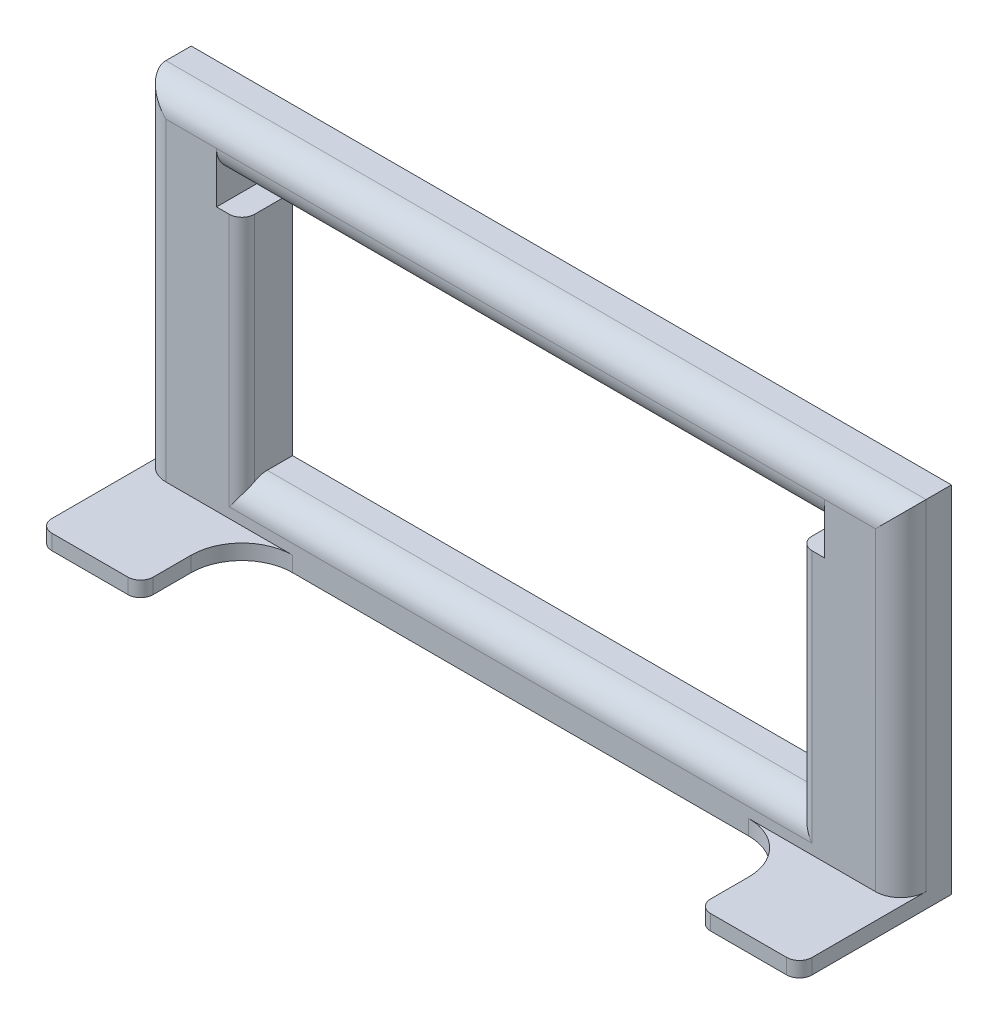
ISO-10303-21;
HEADER;
FILE_DESCRIPTION(('STEP AP214'),'2;1');
FILE_NAME('part.step','',(''),(''),'','','');
FILE_SCHEMA(('AUTOMOTIVE_DESIGN { 1 0 10303 214 1 1 1 1 }'));
ENDSEC;
DATA;
#1=APPLICATION_CONTEXT('core data for automotive mechanical design processes');
#2=APPLICATION_PROTOCOL_DEFINITION('international standard','automotive_design',2000,#1);
#3=PRODUCT_CONTEXT('',#1,'mechanical');
#4=PRODUCT('Part','Part','',(#3));
#5=PRODUCT_RELATED_PRODUCT_CATEGORY('part','',(#4));
#6=PRODUCT_DEFINITION_FORMATION('','',#4);
#7=PRODUCT_DEFINITION_CONTEXT('part definition',#1,'design');
#8=PRODUCT_DEFINITION('design','',#6,#7);
#9=PRODUCT_DEFINITION_SHAPE('','',#8);
#10=(LENGTH_UNIT() NAMED_UNIT(*) SI_UNIT(.MILLI.,.METRE.));
#11=(NAMED_UNIT(*) PLANE_ANGLE_UNIT() SI_UNIT($,.RADIAN.));
#12=(NAMED_UNIT(*) SI_UNIT($,.STERADIAN.) SOLID_ANGLE_UNIT());
#13=UNCERTAINTY_MEASURE_WITH_UNIT(LENGTH_MEASURE(1.E-05),#10,'distance_accuracy_value','');
#14=(GEOMETRIC_REPRESENTATION_CONTEXT(3) GLOBAL_UNCERTAINTY_ASSIGNED_CONTEXT((#13)) GLOBAL_UNIT_ASSIGNED_CONTEXT((#10,
#11,#12)) REPRESENTATION_CONTEXT('',''));
#15=CARTESIAN_POINT('',(0.,0.,0.));
#16=DIRECTION('',(0.,0.,1.));
#17=DIRECTION('',(1.,0.,0.));
#18=AXIS2_PLACEMENT_3D('',#15,#16,#17);
#19=CARTESIAN_POINT('',(0.,-35.,10.));
#20=DIRECTION('',(0.,1.,0.));
#21=DIRECTION('',(0.,0.,1.));
#22=AXIS2_PLACEMENT_3D('',#19,#20,#21);
#23=PLANE('',#22);
#24=DIRECTION('',(0.,0.,-1.));
#25=VECTOR('',#24,1.);
#26=CARTESIAN_POINT('',(75.,-35.,10.));
#27=LINE('',#26,#25);
#28=CARTESIAN_POINT('',(75.,-35.,27.5));
#29=VERTEX_POINT('',#28);
#30=CARTESIAN_POINT('',(75.,-35.,0.));
#31=VERTEX_POINT('',#30);
#32=EDGE_CURVE('E276',#29,#31,#27,.T.);
#33=ORIENTED_EDGE('',*,*,#32,.F.);
#34=CARTESIAN_POINT('',(72.5,-35.,27.5));
#35=DIRECTION('',(0.,1.,0.));
#36=DIRECTION('',(0.,0.,1.));
#37=AXIS2_PLACEMENT_3D('',#34,#35,#36);
#38=CIRCLE('',#37,2.5);
#39=CARTESIAN_POINT('',(72.5,-35.,30.));
#40=VERTEX_POINT('',#39);
#41=EDGE_CURVE('E373',#29,#40,#38,.F.);
#42=ORIENTED_EDGE('',*,*,#41,.T.);
#43=DIRECTION('',(1.,0.,0.));
#44=VECTOR('',#43,1.);
#45=CARTESIAN_POINT('',(-75.,-35.,30.));
#46=LINE('',#45,#44);
#47=CARTESIAN_POINT('',(57.5,-35.,30.));
#48=VERTEX_POINT('',#47);
#49=EDGE_CURVE('E571',#48,#40,#46,.T.);
#50=ORIENTED_EDGE('',*,*,#49,.F.);
#51=CARTESIAN_POINT('',(57.5,-35.,27.5));
#52=DIRECTION('',(0.,1.,0.));
#53=DIRECTION('',(0.,0.,1.));
#54=AXIS2_PLACEMENT_3D('',#51,#52,#53);
#55=CIRCLE('',#54,2.5);
#56=CARTESIAN_POINT('',(55.,-35.,27.5));
#57=VERTEX_POINT('',#56);
#58=EDGE_CURVE('E371',#48,#57,#55,.F.);
#59=ORIENTED_EDGE('',*,*,#58,.T.);
#60=DIRECTION('',(0.,0.,1.));
#61=VECTOR('',#60,1.);
#62=CARTESIAN_POINT('',(55.,-35.,0.));
#63=LINE('',#62,#61);
#64=CARTESIAN_POINT('',(55.,-35.,20.));
#65=VERTEX_POINT('',#64);
#66=EDGE_CURVE('E581',#65,#57,#63,.T.);
#67=ORIENTED_EDGE('',*,*,#66,.F.);
#68=CARTESIAN_POINT('',(45.,-35.,20.));
#69=DIRECTION('',(0.,1.,0.));
#70=DIRECTION('',(0.,0.,1.));
#71=AXIS2_PLACEMENT_3D('',#68,#69,#70);
#72=CIRCLE('',#71,10.);
#73=CARTESIAN_POINT('',(45.,-35.,10.));
#74=VERTEX_POINT('',#73);
#75=EDGE_CURVE('E337',#65,#74,#72,.T.);
#76=ORIENTED_EDGE('',*,*,#75,.T.);
#77=DIRECTION('',(-1.,0.,0.));
#78=VECTOR('',#77,1.);
#79=CARTESIAN_POINT('',(0.,-35.,10.));
#80=LINE('',#79,#78);
#81=CARTESIAN_POINT('',(-45.,-35.,10.));
#82=VERTEX_POINT('',#81);
#83=EDGE_CURVE('E587',#74,#82,#80,.T.);
#84=ORIENTED_EDGE('',*,*,#83,.T.);
#85=CARTESIAN_POINT('',(-45.,-35.,20.));
#86=DIRECTION('',(0.,1.,0.));
#87=DIRECTION('',(0.,0.,1.));
#88=AXIS2_PLACEMENT_3D('',#85,#86,#87);
#89=CIRCLE('',#88,10.);
#90=CARTESIAN_POINT('',(-55.,-35.,20.));
#91=VERTEX_POINT('',#90);
#92=EDGE_CURVE('E342',#82,#91,#89,.T.);
#93=ORIENTED_EDGE('',*,*,#92,.T.);
#94=DIRECTION('',(0.,0.,1.));
#95=VECTOR('',#94,1.);
#96=CARTESIAN_POINT('',(-55.,-35.,0.));
#97=LINE('',#96,#95);
#98=CARTESIAN_POINT('',(-55.,-35.,27.5));
#99=VERTEX_POINT('',#98);
#100=EDGE_CURVE('E584',#91,#99,#97,.T.);
#101=ORIENTED_EDGE('',*,*,#100,.T.);
#102=CARTESIAN_POINT('',(-57.5,-35.,27.5));
#103=DIRECTION('',(0.,1.,0.));
#104=DIRECTION('',(0.,0.,1.));
#105=AXIS2_PLACEMENT_3D('',#102,#103,#104);
#106=CIRCLE('',#105,2.5);
#107=CARTESIAN_POINT('',(-57.5,-35.,30.));
#108=VERTEX_POINT('',#107);
#109=EDGE_CURVE('E367',#99,#108,#106,.F.);
#110=ORIENTED_EDGE('',*,*,#109,.T.);
#111=CARTESIAN_POINT('',(-72.5,-35.,30.));
#112=VERTEX_POINT('',#111);
#113=EDGE_CURVE('E576',#112,#108,#46,.T.);
#114=ORIENTED_EDGE('',*,*,#113,.F.);
#115=CARTESIAN_POINT('',(-72.5,-35.,27.5));
#116=DIRECTION('',(0.,1.,0.));
#117=DIRECTION('',(0.,0.,1.));
#118=AXIS2_PLACEMENT_3D('',#115,#116,#117);
#119=CIRCLE('',#118,2.5);
#120=CARTESIAN_POINT('',(-75.,-35.,27.5));
#121=VERTEX_POINT('',#120);
#122=EDGE_CURVE('E369',#112,#121,#119,.F.);
#123=ORIENTED_EDGE('',*,*,#122,.T.);
#124=DIRECTION('',(0.,0.,-1.));
#125=VECTOR('',#124,1.);
#126=CARTESIAN_POINT('',(-75.,-35.,10.));
#127=LINE('',#126,#125);
#128=CARTESIAN_POINT('',(-75.,-35.,0.));
#129=VERTEX_POINT('',#128);
#130=EDGE_CURVE('E539',#121,#129,#127,.T.);
#131=ORIENTED_EDGE('',*,*,#130,.T.);
#132=DIRECTION('',(1.,0.,0.));
#133=VECTOR('',#132,1.);
#134=CARTESIAN_POINT('',(0.,-35.,0.));
#135=LINE('',#134,#133);
#136=EDGE_CURVE('E535',#129,#31,#135,.T.);
#137=ORIENTED_EDGE('',*,*,#136,.T.);
#138=EDGE_LOOP('',(#33,#42,#50,#59,#67,#76,#84,#93,#101,#110,#114,#123,#131,#137));
#139=FACE_BOUND('',#138,.T.);
#140=ADVANCED_FACE('F35',(#139),#23,.F.);
#141=CARTESIAN_POINT('',(-75.,-32.,30.));
#142=DIRECTION('',(0.,-1.,0.));
#143=DIRECTION('',(0.,0.,-1.));
#144=AXIS2_PLACEMENT_3D('',#141,#142,#143);
#145=PLANE('',#144);
#146=DIRECTION('',(-1.,0.,0.));
#147=VECTOR('',#146,1.);
#148=CARTESIAN_POINT('',(-75.,-32.,30.));
#149=LINE('',#148,#147);
#150=CARTESIAN_POINT('',(72.5,-32.,30.));
#151=VERTEX_POINT('',#150);
#152=CARTESIAN_POINT('',(57.5,-32.,30.));
#153=VERTEX_POINT('',#152);
#154=EDGE_CURVE('E568',#151,#153,#149,.T.);
#155=ORIENTED_EDGE('',*,*,#154,.F.);
#156=CARTESIAN_POINT('',(72.5,-32.,27.5));
#157=DIRECTION('',(0.,-1.,0.));
#158=DIRECTION('',(0.,0.,-1.));
#159=AXIS2_PLACEMENT_3D('',#156,#157,#158);
#160=CIRCLE('',#159,2.5);
#161=CARTESIAN_POINT('',(75.,-32.,27.5));
#162=VERTEX_POINT('',#161);
#163=EDGE_CURVE('E363',#151,#162,#160,.F.);
#164=ORIENTED_EDGE('',*,*,#163,.T.);
#165=DIRECTION('',(0.,0.,-1.));
#166=VECTOR('',#165,1.);
#167=CARTESIAN_POINT('',(75.,-32.,30.));
#168=LINE('',#167,#166);
#169=CARTESIAN_POINT('',(75.,-32.,5.));
#170=VERTEX_POINT('',#169);
#171=EDGE_CURVE('E506',#162,#170,#168,.T.);
#172=ORIENTED_EDGE('',*,*,#171,.T.);
#173=CARTESIAN_POINT('',(70.,-32.,5.));
#174=DIRECTION('',(0.,-1.,0.));
#175=DIRECTION('',(0.,0.,-1.));
#176=AXIS2_PLACEMENT_3D('',#173,#174,#175);
#177=CIRCLE('',#176,5.);
#178=CARTESIAN_POINT('',(70.,-32.,10.));
#179=VERTEX_POINT('',#178);
#180=EDGE_CURVE('E303',#170,#179,#177,.T.);
#181=ORIENTED_EDGE('',*,*,#180,.T.);
#182=DIRECTION('',(-1.,0.,0.));
#183=VECTOR('',#182,1.);
#184=CARTESIAN_POINT('',(-75.,-32.,10.));
#185=LINE('',#184,#183);
#186=CARTESIAN_POINT('',(45.,-32.,10.));
#187=VERTEX_POINT('',#186);
#188=EDGE_CURVE('E569',#179,#187,#185,.T.);
#189=ORIENTED_EDGE('',*,*,#188,.T.);
#190=CARTESIAN_POINT('',(45.,-32.,20.));
#191=DIRECTION('',(0.,-1.,0.));
#192=DIRECTION('',(0.,0.,-1.));
#193=AXIS2_PLACEMENT_3D('',#190,#191,#192);
#194=CIRCLE('',#193,10.);
#195=CARTESIAN_POINT('',(55.,-32.,20.));
#196=VERTEX_POINT('',#195);
#197=EDGE_CURVE('E335',#187,#196,#194,.T.);
#198=ORIENTED_EDGE('',*,*,#197,.T.);
#199=DIRECTION('',(0.,0.,1.));
#200=VECTOR('',#199,1.);
#201=CARTESIAN_POINT('',(55.,-32.,0.));
#202=LINE('',#201,#200);
#203=CARTESIAN_POINT('',(55.,-32.,27.5));
#204=VERTEX_POINT('',#203);
#205=EDGE_CURVE('E325',#196,#204,#202,.T.);
#206=ORIENTED_EDGE('',*,*,#205,.T.);
#207=CARTESIAN_POINT('',(57.5,-32.,27.5));
#208=DIRECTION('',(0.,-1.,0.));
#209=DIRECTION('',(0.,0.,-1.));
#210=AXIS2_PLACEMENT_3D('',#207,#208,#209);
#211=CIRCLE('',#210,2.5);
#212=EDGE_CURVE('E361',#204,#153,#211,.F.);
#213=ORIENTED_EDGE('',*,*,#212,.T.);
#214=EDGE_LOOP('',(#155,#164,#172,#181,#189,#198,#206,#213));
#215=FACE_BOUND('',#214,.T.);
#216=ADVANCED_FACE('F421',(#215),#145,.F.);
#217=CARTESIAN_POINT('',(0.,0.,30.));
#218=DIRECTION('',(0.,0.,-1.));
#219=DIRECTION('',(-1.,0.,0.));
#220=AXIS2_PLACEMENT_3D('',#217,#218,#219);
#221=PLANE('',#220);
#222=ORIENTED_EDGE('',*,*,#49,.T.);
#223=DIRECTION('',(0.,1.,0.));
#224=VECTOR('',#223,1.);
#225=CARTESIAN_POINT('',(72.5,-32.,30.));
#226=LINE('',#225,#224);
#227=EDGE_CURVE('E358',#40,#151,#226,.T.);
#228=ORIENTED_EDGE('',*,*,#227,.T.);
#229=ORIENTED_EDGE('',*,*,#154,.T.);
#230=DIRECTION('',(0.,1.,0.));
#231=VECTOR('',#230,1.);
#232=CARTESIAN_POINT('',(57.5,-35.,30.));
#233=LINE('',#232,#231);
#234=EDGE_CURVE('E356',#153,#48,#233,.F.);
#235=ORIENTED_EDGE('',*,*,#234,.T.);
#236=EDGE_LOOP('',(#222,#228,#229,#235));
#237=FACE_BOUND('',#236,.T.);
#238=ADVANCED_FACE('F427',(#237),#221,.F.);
#239=CARTESIAN_POINT('',(75.,0.,10.));
#240=DIRECTION('',(1.,0.,0.));
#241=DIRECTION('',(0.,0.,-1.));
#242=AXIS2_PLACEMENT_3D('',#239,#240,#241);
#243=PLANE('',#242);
#244=ORIENTED_EDGE('',*,*,#171,.F.);
#245=DIRECTION('',(0.,1.,0.));
#246=VECTOR('',#245,1.);
#247=CARTESIAN_POINT('',(75.,-35.,27.5));
#248=LINE('',#247,#246);
#249=EDGE_CURVE('E365',#162,#29,#248,.F.);
#250=ORIENTED_EDGE('',*,*,#249,.T.);
#251=ORIENTED_EDGE('',*,*,#32,.T.);
#252=DIRECTION('',(0.,-1.,0.));
#253=VECTOR('',#252,1.);
#254=CARTESIAN_POINT('',(75.,0.,0.));
#255=LINE('',#254,#253);
#256=CARTESIAN_POINT('',(75.,35.,0.));
#257=VERTEX_POINT('',#256);
#258=EDGE_CURVE('E526',#257,#31,#255,.T.);
#259=ORIENTED_EDGE('',*,*,#258,.F.);
#260=DIRECTION('',(0.,0.,-1.));
#261=VECTOR('',#260,1.);
#262=CARTESIAN_POINT('',(75.,35.,10.));
#263=LINE('',#262,#261);
#264=CARTESIAN_POINT('',(75.,35.,5.));
#265=VERTEX_POINT('',#264);
#266=EDGE_CURVE('E279',#265,#257,#263,.T.);
#267=ORIENTED_EDGE('',*,*,#266,.F.);
#268=DIRECTION('',(0.,-1.,0.));
#269=VECTOR('',#268,1.);
#270=CARTESIAN_POINT('',(75.,0.,5.));
#271=LINE('',#270,#269);
#272=EDGE_CURVE('E290',#265,#170,#271,.T.);
#273=ORIENTED_EDGE('',*,*,#272,.T.);
#274=EDGE_LOOP('',(#244,#250,#251,#259,#267,#273));
#275=FACE_BOUND('',#274,.T.);
#276=ADVANCED_FACE('F443',(#275),#243,.T.);
#277=CARTESIAN_POINT('',(0.,35.,10.));
#278=DIRECTION('',(0.,1.,0.));
#279=DIRECTION('',(0.,0.,1.));
#280=AXIS2_PLACEMENT_3D('',#277,#278,#279);
#281=PLANE('',#280);
#282=DIRECTION('',(0.,0.,-1.));
#283=VECTOR('',#282,1.);
#284=CARTESIAN_POINT('',(-75.,35.,10.));
#285=LINE('',#284,#283);
#286=CARTESIAN_POINT('',(-75.,35.,5.));
#287=VERTEX_POINT('',#286);
#288=CARTESIAN_POINT('',(-75.,35.,0.));
#289=VERTEX_POINT('',#288);
#290=EDGE_CURVE('E541',#287,#289,#285,.T.);
#291=ORIENTED_EDGE('',*,*,#290,.F.);
#292=DIRECTION('',(1.,0.,0.));
#293=VECTOR('',#292,1.);
#294=CARTESIAN_POINT('',(0.,35.,5.));
#295=LINE('',#294,#293);
#296=EDGE_CURVE('E293',#287,#265,#295,.T.);
#297=ORIENTED_EDGE('',*,*,#296,.T.);
#298=ORIENTED_EDGE('',*,*,#266,.T.);
#299=DIRECTION('',(1.,0.,0.));
#300=VECTOR('',#299,1.);
#301=CARTESIAN_POINT('',(0.,35.,0.));
#302=LINE('',#301,#300);
#303=EDGE_CURVE('E529',#289,#257,#302,.T.);
#304=ORIENTED_EDGE('',*,*,#303,.F.);
#305=EDGE_LOOP('',(#291,#297,#298,#304));
#306=FACE_BOUND('',#305,.T.);
#307=ADVANCED_FACE('F440',(#306),#281,.T.);
#308=CARTESIAN_POINT('',(-75.,0.,10.));
#309=DIRECTION('',(1.,0.,0.));
#310=DIRECTION('',(0.,1.,0.));
#311=AXIS2_PLACEMENT_3D('',#308,#309,#310);
#312=PLANE('',#311);
#313=ORIENTED_EDGE('',*,*,#130,.F.);
#314=DIRECTION('',(0.,-1.,0.));
#315=VECTOR('',#314,1.);
#316=CARTESIAN_POINT('',(-75.,0.,27.5));
#317=LINE('',#316,#315);
#318=CARTESIAN_POINT('',(-75.,-32.,27.5));
#319=VERTEX_POINT('',#318);
#320=EDGE_CURVE('E64',#121,#319,#317,.F.);
#321=ORIENTED_EDGE('',*,*,#320,.T.);
#322=DIRECTION('',(0.,0.,-1.));
#323=VECTOR('',#322,1.);
#324=CARTESIAN_POINT('',(-75.,-32.,30.));
#325=LINE('',#324,#323);
#326=CARTESIAN_POINT('',(-75.,-32.,5.));
#327=VERTEX_POINT('',#326);
#328=EDGE_CURVE('E566',#319,#327,#325,.T.);
#329=ORIENTED_EDGE('',*,*,#328,.T.);
#330=DIRECTION('',(0.,-1.,0.));
#331=VECTOR('',#330,1.);
#332=CARTESIAN_POINT('',(-75.,35.,5.));
#333=LINE('',#332,#331);
#334=EDGE_CURVE('E288',#327,#287,#333,.F.);
#335=ORIENTED_EDGE('',*,*,#334,.T.);
#336=ORIENTED_EDGE('',*,*,#290,.T.);
#337=DIRECTION('',(0.,-1.,0.));
#338=VECTOR('',#337,1.);
#339=CARTESIAN_POINT('',(-75.,0.,0.));
#340=LINE('',#339,#338);
#341=EDGE_CURVE('E532',#289,#129,#340,.T.);
#342=ORIENTED_EDGE('',*,*,#341,.T.);
#343=EDGE_LOOP('',(#313,#321,#329,#335,#336,#342));
#344=FACE_BOUND('',#343,.T.);
#345=ADVANCED_FACE('F436',(#344),#312,.F.);
#346=CARTESIAN_POINT('',(-60.,0.,10.));
#347=DIRECTION('',(1.,0.,0.));
#348=DIRECTION('',(0.,0.,-1.));
#349=AXIS2_PLACEMENT_3D('',#346,#347,#348);
#350=PLANE('',#349);
#351=DIRECTION('',(0.,-1.,0.));
#352=VECTOR('',#351,1.);
#353=CARTESIAN_POINT('',(-60.,0.,0.));
#354=LINE('',#353,#352);
#355=CARTESIAN_POINT('',(-60.,25.,0.));
#356=VERTEX_POINT('',#355);
#357=CARTESIAN_POINT('',(-60.,20.,0.));
#358=VERTEX_POINT('',#357);
#359=EDGE_CURVE('E498',#356,#358,#354,.T.);
#360=ORIENTED_EDGE('',*,*,#359,.F.);
#361=DIRECTION('',(0.,0.,-1.));
#362=VECTOR('',#361,1.);
#363=CARTESIAN_POINT('',(-60.,25.,10.));
#364=LINE('',#363,#362);
#365=CARTESIAN_POINT('',(-60.,25.,5.));
#366=VERTEX_POINT('',#365);
#367=EDGE_CURVE('E269',#366,#356,#364,.T.);
#368=ORIENTED_EDGE('',*,*,#367,.F.);
#369=CARTESIAN_POINT('',(-60.,30.,5.));
#370=DIRECTION('',(1.,0.,0.));
#371=DIRECTION('',(0.,0.,-1.));
#372=AXIS2_PLACEMENT_3D('',#369,#370,#371);
#373=CIRCLE('',#372,5.);
#374=CARTESIAN_POINT('',(-60.,30.,10.));
#375=VERTEX_POINT('',#374);
#376=EDGE_CURVE('E305',#366,#375,#373,.F.);
#377=ORIENTED_EDGE('',*,*,#376,.T.);
#378=DIRECTION('',(0.,-1.,0.));
#379=VECTOR('',#378,1.);
#380=CARTESIAN_POINT('',(-60.,0.,10.));
#381=LINE('',#380,#379);
#382=CARTESIAN_POINT('',(-60.,20.,10.));
#383=VERTEX_POINT('',#382);
#384=EDGE_CURVE('E260',#375,#383,#381,.T.);
#385=ORIENTED_EDGE('',*,*,#384,.T.);
#386=DIRECTION('',(0.,0.,-1.));
#387=VECTOR('',#386,1.);
#388=CARTESIAN_POINT('',(-60.,20.,10.));
#389=LINE('',#388,#387);
#390=EDGE_CURVE('E501',#383,#358,#389,.T.);
#391=ORIENTED_EDGE('',*,*,#390,.T.);
#392=EDGE_LOOP('',(#360,#368,#377,#385,#391));
#393=FACE_BOUND('',#392,.T.);
#394=ADVANCED_FACE('F439',(#393),#350,.T.);
#395=CARTESIAN_POINT('',(0.,25.,10.));
#396=DIRECTION('',(0.,-1.,0.));
#397=DIRECTION('',(0.,0.,-1.));
#398=AXIS2_PLACEMENT_3D('',#395,#396,#397);
#399=PLANE('',#398);
#400=DIRECTION('',(0.,0.,-1.));
#401=VECTOR('',#400,1.);
#402=CARTESIAN_POINT('',(60.,25.,10.));
#403=LINE('',#402,#401);
#404=CARTESIAN_POINT('',(60.,25.,5.));
#405=VERTEX_POINT('',#404);
#406=CARTESIAN_POINT('',(60.,25.,0.));
#407=VERTEX_POINT('',#406);
#408=EDGE_CURVE('E266',#405,#407,#403,.T.);
#409=ORIENTED_EDGE('',*,*,#408,.F.);
#410=DIRECTION('',(-1.,0.,0.));
#411=VECTOR('',#410,1.);
#412=CARTESIAN_POINT('',(0.,25.,5.));
#413=LINE('',#412,#411);
#414=EDGE_CURVE('E295',#405,#366,#413,.T.);
#415=ORIENTED_EDGE('',*,*,#414,.T.);
#416=ORIENTED_EDGE('',*,*,#367,.T.);
#417=DIRECTION('',(-1.,0.,0.));
#418=VECTOR('',#417,1.);
#419=CARTESIAN_POINT('',(0.,25.,0.));
#420=LINE('',#419,#418);
#421=EDGE_CURVE('E505',#407,#356,#420,.T.);
#422=ORIENTED_EDGE('',*,*,#421,.F.);
#423=EDGE_LOOP('',(#409,#415,#416,#422));
#424=FACE_BOUND('',#423,.T.);
#425=ADVANCED_FACE('F468',(#424),#399,.T.);
#426=CARTESIAN_POINT('',(60.,0.,10.));
#427=DIRECTION('',(1.,0.,0.));
#428=DIRECTION('',(0.,1.,0.));
#429=AXIS2_PLACEMENT_3D('',#426,#427,#428);
#430=PLANE('',#429);
#431=DIRECTION('',(0.,-1.,0.));
#432=VECTOR('',#431,1.);
#433=CARTESIAN_POINT('',(60.,0.,0.));
#434=LINE('',#433,#432);
#435=CARTESIAN_POINT('',(60.,20.,0.));
#436=VERTEX_POINT('',#435);
#437=EDGE_CURVE('E264',#407,#436,#434,.T.);
#438=ORIENTED_EDGE('',*,*,#437,.T.);
#439=DIRECTION('',(0.,0.,-1.));
#440=VECTOR('',#439,1.);
#441=CARTESIAN_POINT('',(60.,20.,10.));
#442=LINE('',#441,#440);
#443=CARTESIAN_POINT('',(60.,20.,10.));
#444=VERTEX_POINT('',#443);
#445=EDGE_CURVE('E244',#444,#436,#442,.T.);
#446=ORIENTED_EDGE('',*,*,#445,.F.);
#447=DIRECTION('',(0.,-1.,0.));
#448=VECTOR('',#447,1.);
#449=CARTESIAN_POINT('',(60.,0.,10.));
#450=LINE('',#449,#448);
#451=CARTESIAN_POINT('',(60.,30.,10.));
#452=VERTEX_POINT('',#451);
#453=EDGE_CURVE('E252',#452,#444,#450,.T.);
#454=ORIENTED_EDGE('',*,*,#453,.F.);
#455=CARTESIAN_POINT('',(60.,30.,5.));
#456=DIRECTION('',(1.,0.,0.));
#457=DIRECTION('',(0.,1.,0.));
#458=AXIS2_PLACEMENT_3D('',#455,#456,#457);
#459=CIRCLE('',#458,5.);
#460=EDGE_CURVE('E308',#452,#405,#459,.T.);
#461=ORIENTED_EDGE('',*,*,#460,.T.);
#462=ORIENTED_EDGE('',*,*,#408,.T.);
#463=EDGE_LOOP('',(#438,#446,#454,#461,#462));
#464=FACE_BOUND('',#463,.T.);
#465=ADVANCED_FACE('F262',(#464),#430,.F.);
#466=CARTESIAN_POINT('',(0.,20.,10.));
#467=DIRECTION('',(0.,1.,0.));
#468=DIRECTION('',(0.,0.,1.));
#469=AXIS2_PLACEMENT_3D('',#466,#467,#468);
#470=PLANE('',#469);
#471=DIRECTION('',(0.,0.,-1.));
#472=VECTOR('',#471,1.);
#473=CARTESIAN_POINT('',(55.,20.,10.));
#474=LINE('',#473,#472);
#475=CARTESIAN_POINT('',(55.,20.,7.5));
#476=VERTEX_POINT('',#475);
#477=CARTESIAN_POINT('',(55.,20.,0.));
#478=VERTEX_POINT('',#477);
#479=EDGE_CURVE('E267',#476,#478,#474,.T.);
#480=ORIENTED_EDGE('',*,*,#479,.F.);
#481=CARTESIAN_POINT('',(57.5,20.,7.5));
#482=DIRECTION('',(0.,1.,0.));
#483=DIRECTION('',(0.,0.,1.));
#484=AXIS2_PLACEMENT_3D('',#481,#482,#483);
#485=CIRCLE('',#484,2.5);
#486=CARTESIAN_POINT('',(57.5,20.,10.));
#487=VERTEX_POINT('',#486);
#488=EDGE_CURVE('E247',#476,#487,#485,.T.);
#489=ORIENTED_EDGE('',*,*,#488,.T.);
#490=DIRECTION('',(1.,0.,0.));
#491=VECTOR('',#490,1.);
#492=CARTESIAN_POINT('',(0.,20.,10.));
#493=LINE('',#492,#491);
#494=EDGE_CURVE('E238',#487,#444,#493,.T.);
#495=ORIENTED_EDGE('',*,*,#494,.T.);
#496=ORIENTED_EDGE('',*,*,#445,.T.);
#497=DIRECTION('',(1.,0.,0.));
#498=VECTOR('',#497,1.);
#499=CARTESIAN_POINT('',(0.,20.,0.));
#500=LINE('',#499,#498);
#501=EDGE_CURVE('E510',#478,#436,#500,.T.);
#502=ORIENTED_EDGE('',*,*,#501,.F.);
#503=EDGE_LOOP('',(#480,#489,#495,#496,#502));
#504=FACE_BOUND('',#503,.T.);
#505=ADVANCED_FACE('F241',(#504),#470,.T.);
#506=CARTESIAN_POINT('',(55.,0.,10.));
#507=DIRECTION('',(1.,0.,0.));
#508=DIRECTION('',(0.,1.,0.));
#509=AXIS2_PLACEMENT_3D('',#506,#507,#508);
#510=PLANE('',#509);
#511=CARTESIAN_POINT('',(55.,-30.,5.));
#512=DIRECTION('',(1.,0.,0.));
#513=DIRECTION('',(0.,1.,0.));
#514=AXIS2_PLACEMENT_3D('',#511,#512,#513);
#515=CIRCLE('',#514,5.);
#516=CARTESIAN_POINT('',(55.,-25.,5.));
#517=VERTEX_POINT('',#516);
#518=CARTESIAN_POINT('',(55.,-25.6698729810778,7.5));
#519=VERTEX_POINT('',#518);
#520=EDGE_CURVE('E310',#517,#519,#515,.T.);
#521=ORIENTED_EDGE('',*,*,#520,.T.);
#522=DIRECTION('',(0.,-1.,0.));
#523=VECTOR('',#522,1.);
#524=CARTESIAN_POINT('',(55.,20.,7.5));
#525=LINE('',#524,#523);
#526=EDGE_CURVE('E353',#519,#476,#525,.F.);
#527=ORIENTED_EDGE('',*,*,#526,.T.);
#528=ORIENTED_EDGE('',*,*,#479,.T.);
#529=DIRECTION('',(0.,-1.,0.));
#530=VECTOR('',#529,1.);
#531=CARTESIAN_POINT('',(55.,0.,0.));
#532=LINE('',#531,#530);
#533=CARTESIAN_POINT('',(55.,-25.,0.));
#534=VERTEX_POINT('',#533);
#535=EDGE_CURVE('E515',#478,#534,#532,.T.);
#536=ORIENTED_EDGE('',*,*,#535,.T.);
#537=DIRECTION('',(0.,0.,-1.));
#538=VECTOR('',#537,1.);
#539=CARTESIAN_POINT('',(55.,-25.,10.));
#540=LINE('',#539,#538);
#541=EDGE_CURVE('E271',#517,#534,#540,.T.);
#542=ORIENTED_EDGE('',*,*,#541,.F.);
#543=EDGE_LOOP('',(#521,#527,#528,#536,#542));
#544=FACE_BOUND('',#543,.T.);
#545=ADVANCED_FACE('F459',(#544),#510,.F.);
#546=CARTESIAN_POINT('',(0.,-25.,10.));
#547=DIRECTION('',(0.,1.,0.));
#548=DIRECTION('',(0.,0.,1.));
#549=AXIS2_PLACEMENT_3D('',#546,#547,#548);
#550=PLANE('',#549);
#551=DIRECTION('',(0.,0.,-1.));
#552=VECTOR('',#551,1.);
#553=CARTESIAN_POINT('',(-55.,-25.,10.));
#554=LINE('',#553,#552);
#555=CARTESIAN_POINT('',(-55.,-25.,5.));
#556=VERTEX_POINT('',#555);
#557=CARTESIAN_POINT('',(-55.,-25.,0.));
#558=VERTEX_POINT('',#557);
#559=EDGE_CURVE('E547',#556,#558,#554,.T.);
#560=ORIENTED_EDGE('',*,*,#559,.F.);
#561=DIRECTION('',(1.,0.,0.));
#562=VECTOR('',#561,1.);
#563=CARTESIAN_POINT('',(0.,-25.,5.));
#564=LINE('',#563,#562);
#565=EDGE_CURVE('E297',#556,#517,#564,.T.);
#566=ORIENTED_EDGE('',*,*,#565,.T.);
#567=ORIENTED_EDGE('',*,*,#541,.T.);
#568=DIRECTION('',(1.,0.,0.));
#569=VECTOR('',#568,1.);
#570=CARTESIAN_POINT('',(0.,-25.,0.));
#571=LINE('',#570,#569);
#572=EDGE_CURVE('E518',#558,#534,#571,.T.);
#573=ORIENTED_EDGE('',*,*,#572,.F.);
#574=EDGE_LOOP('',(#560,#566,#567,#573));
#575=FACE_BOUND('',#574,.T.);
#576=ADVANCED_FACE('F455',(#575),#550,.T.);
#577=CARTESIAN_POINT('',(-55.,0.,10.));
#578=DIRECTION('',(1.,0.,0.));
#579=DIRECTION('',(0.,1.,0.));
#580=AXIS2_PLACEMENT_3D('',#577,#578,#579);
#581=PLANE('',#580);
#582=DIRECTION('',(0.,0.,-1.));
#583=VECTOR('',#582,1.);
#584=CARTESIAN_POINT('',(-55.,20.,10.));
#585=LINE('',#584,#583);
#586=CARTESIAN_POINT('',(-55.,20.,7.5));
#587=VERTEX_POINT('',#586);
#588=CARTESIAN_POINT('',(-55.,20.,0.));
#589=VERTEX_POINT('',#588);
#590=EDGE_CURVE('E545',#587,#589,#585,.T.);
#591=ORIENTED_EDGE('',*,*,#590,.F.);
#592=DIRECTION('',(0.,-1.,0.));
#593=VECTOR('',#592,1.);
#594=CARTESIAN_POINT('',(-55.,0.,7.5));
#595=LINE('',#594,#593);
#596=CARTESIAN_POINT('',(-55.,-25.6698729810778,7.5));
#597=VERTEX_POINT('',#596);
#598=EDGE_CURVE('E344',#587,#597,#595,.T.);
#599=ORIENTED_EDGE('',*,*,#598,.T.);
#600=CARTESIAN_POINT('',(-55.,-30.,5.));
#601=DIRECTION('',(1.,0.,0.));
#602=DIRECTION('',(0.,1.,0.));
#603=AXIS2_PLACEMENT_3D('',#600,#601,#602);
#604=CIRCLE('',#603,5.);
#605=EDGE_CURVE('E313',#597,#556,#604,.F.);
#606=ORIENTED_EDGE('',*,*,#605,.T.);
#607=ORIENTED_EDGE('',*,*,#559,.T.);
#608=DIRECTION('',(0.,-1.,0.));
#609=VECTOR('',#608,1.);
#610=CARTESIAN_POINT('',(-55.,0.,0.));
#611=LINE('',#610,#609);
#612=EDGE_CURVE('E521',#589,#558,#611,.T.);
#613=ORIENTED_EDGE('',*,*,#612,.F.);
#614=EDGE_LOOP('',(#591,#599,#606,#607,#613));
#615=FACE_BOUND('',#614,.T.);
#616=ADVANCED_FACE('F451',(#615),#581,.T.);
#617=CARTESIAN_POINT('',(0.,20.,10.));
#618=DIRECTION('',(0.,-1.,0.));
#619=DIRECTION('',(0.,0.,-1.));
#620=AXIS2_PLACEMENT_3D('',#617,#618,#619);
#621=PLANE('',#620);
#622=DIRECTION('',(-1.,0.,0.));
#623=VECTOR('',#622,1.);
#624=CARTESIAN_POINT('',(0.,20.,10.));
#625=LINE('',#624,#623);
#626=CARTESIAN_POINT('',(-57.5,20.,10.));
#627=VERTEX_POINT('',#626);
#628=EDGE_CURVE('E251',#627,#383,#625,.T.);
#629=ORIENTED_EDGE('',*,*,#628,.F.);
#630=CARTESIAN_POINT('',(-57.5,20.,7.5));
#631=DIRECTION('',(0.,-1.,0.));
#632=DIRECTION('',(0.,0.,-1.));
#633=AXIS2_PLACEMENT_3D('',#630,#631,#632);
#634=CIRCLE('',#633,2.5);
#635=EDGE_CURVE('E351',#627,#587,#634,.F.);
#636=ORIENTED_EDGE('',*,*,#635,.T.);
#637=ORIENTED_EDGE('',*,*,#590,.T.);
#638=DIRECTION('',(-1.,0.,0.));
#639=VECTOR('',#638,1.);
#640=CARTESIAN_POINT('',(0.,20.,0.));
#641=LINE('',#640,#639);
#642=EDGE_CURVE('E524',#589,#358,#641,.T.);
#643=ORIENTED_EDGE('',*,*,#642,.T.);
#644=ORIENTED_EDGE('',*,*,#390,.F.);
#645=EDGE_LOOP('',(#629,#636,#637,#643,#644));
#646=FACE_BOUND('',#645,.T.);
#647=ADVANCED_FACE('F448',(#646),#621,.F.);
#648=CARTESIAN_POINT('',(0.,0.,10.));
#649=DIRECTION('',(0.,0.,1.));
#650=DIRECTION('',(1.,0.,0.));
#651=AXIS2_PLACEMENT_3D('',#648,#649,#650);
#652=PLANE('',#651);
#653=DIRECTION('',(1.,0.,0.));
#654=VECTOR('',#653,1.);
#655=CARTESIAN_POINT('',(0.,-30.,10.));
#656=LINE('',#655,#654);
#657=CARTESIAN_POINT('',(57.5,-30.,10.));
#658=VERTEX_POINT('',#657);
#659=CARTESIAN_POINT('',(-57.5,-30.,10.));
#660=VERTEX_POINT('',#659);
#661=EDGE_CURVE('E277',#658,#660,#656,.F.);
#662=ORIENTED_EDGE('',*,*,#661,.T.);
#663=DIRECTION('',(0.,-1.,0.));
#664=VECTOR('',#663,1.);
#665=CARTESIAN_POINT('',(-57.5,0.,10.));
#666=LINE('',#665,#664);
#667=EDGE_CURVE('E349',#660,#627,#666,.F.);
#668=ORIENTED_EDGE('',*,*,#667,.T.);
#669=ORIENTED_EDGE('',*,*,#628,.T.);
#670=ORIENTED_EDGE('',*,*,#384,.F.);
#671=DIRECTION('',(1.,0.,0.));
#672=VECTOR('',#671,1.);
#673=CARTESIAN_POINT('',(0.,30.,10.));
#674=LINE('',#673,#672);
#675=CARTESIAN_POINT('',(-70.,30.,10.));
#676=VERTEX_POINT('',#675);
#677=EDGE_CURVE('E283',#375,#676,#674,.F.);
#678=ORIENTED_EDGE('',*,*,#677,.T.);
#679=DIRECTION('',(0.,-1.,0.));
#680=VECTOR('',#679,1.);
#681=CARTESIAN_POINT('',(-70.,-32.,10.));
#682=LINE('',#681,#680);
#683=CARTESIAN_POINT('',(-70.,-32.,10.));
#684=VERTEX_POINT('',#683);
#685=EDGE_CURVE('E285',#676,#684,#682,.T.);
#686=ORIENTED_EDGE('',*,*,#685,.T.);
#687=CARTESIAN_POINT('',(-45.,-32.,10.));
#688=VERTEX_POINT('',#687);
#689=EDGE_CURVE('E572',#688,#684,#185,.T.);
#690=ORIENTED_EDGE('',*,*,#689,.F.);
#691=DIRECTION('',(0.,1.,0.));
#692=VECTOR('',#691,1.);
#693=CARTESIAN_POINT('',(-45.,0.,10.));
#694=LINE('',#693,#692);
#695=EDGE_CURVE('E315',#688,#82,#694,.F.);
#696=ORIENTED_EDGE('',*,*,#695,.T.);
#697=ORIENTED_EDGE('',*,*,#83,.F.);
#698=DIRECTION('',(0.,1.,0.));
#699=VECTOR('',#698,1.);
#700=CARTESIAN_POINT('',(45.,-32.,10.));
#701=LINE('',#700,#699);
#702=EDGE_CURVE('E327',#74,#187,#701,.T.);
#703=ORIENTED_EDGE('',*,*,#702,.T.);
#704=ORIENTED_EDGE('',*,*,#188,.F.);
#705=DIRECTION('',(0.,-1.,0.));
#706=VECTOR('',#705,1.);
#707=CARTESIAN_POINT('',(70.,0.,10.));
#708=LINE('',#707,#706);
#709=CARTESIAN_POINT('',(70.,30.,10.));
#710=VERTEX_POINT('',#709);
#711=EDGE_CURVE('E281',#179,#710,#708,.F.);
#712=ORIENTED_EDGE('',*,*,#711,.T.);
#713=DIRECTION('',(1.,0.,0.));
#714=VECTOR('',#713,1.);
#715=CARTESIAN_POINT('',(0.,30.,10.));
#716=LINE('',#715,#714);
#717=EDGE_CURVE('E257',#710,#452,#716,.F.);
#718=ORIENTED_EDGE('',*,*,#717,.T.);
#719=ORIENTED_EDGE('',*,*,#453,.T.);
#720=ORIENTED_EDGE('',*,*,#494,.F.);
#721=DIRECTION('',(0.,-1.,0.));
#722=VECTOR('',#721,1.);
#723=CARTESIAN_POINT('',(57.5,-30.,10.));
#724=LINE('',#723,#722);
#725=EDGE_CURVE('E347',#487,#658,#724,.T.);
#726=ORIENTED_EDGE('',*,*,#725,.T.);
#727=EDGE_LOOP('',(#662,#668,#669,#670,#678,#686,#690,#696,#697,#703,#704,#712,#718,#719,#720,#726));
#728=FACE_BOUND('',#727,.T.);
#729=ADVANCED_FACE('F255',(#728),#652,.T.);
#730=CARTESIAN_POINT('',(0.,0.,0.));
#731=DIRECTION('',(0.,0.,1.));
#732=DIRECTION('',(1.,0.,0.));
#733=AXIS2_PLACEMENT_3D('',#730,#731,#732);
#734=PLANE('',#733);
#735=ORIENTED_EDGE('',*,*,#359,.T.);
#736=ORIENTED_EDGE('',*,*,#642,.F.);
#737=ORIENTED_EDGE('',*,*,#612,.T.);
#738=ORIENTED_EDGE('',*,*,#572,.T.);
#739=ORIENTED_EDGE('',*,*,#535,.F.);
#740=ORIENTED_EDGE('',*,*,#501,.T.);
#741=ORIENTED_EDGE('',*,*,#437,.F.);
#742=ORIENTED_EDGE('',*,*,#421,.T.);
#743=EDGE_LOOP('',(#735,#736,#737,#738,#739,#740,#741,#742));
#744=FACE_BOUND('',#743,.T.);
#745=ORIENTED_EDGE('',*,*,#258,.T.);
#746=ORIENTED_EDGE('',*,*,#136,.F.);
#747=ORIENTED_EDGE('',*,*,#341,.F.);
#748=ORIENTED_EDGE('',*,*,#303,.T.);
#749=EDGE_LOOP('',(#745,#746,#747,#748));
#750=FACE_BOUND('',#749,.T.);
#751=ADVANCED_FACE('F434',(#744,#750),#734,.F.);
#752=ORIENTED_EDGE('',*,*,#328,.F.);
#753=CARTESIAN_POINT('',(-72.5,-32.,27.5));
#754=DIRECTION('',(0.,-1.,0.));
#755=DIRECTION('',(0.,0.,-1.));
#756=AXIS2_PLACEMENT_3D('',#753,#754,#755);
#757=CIRCLE('',#756,2.5);
#758=CARTESIAN_POINT('',(-72.5,-32.,30.));
#759=VERTEX_POINT('',#758);
#760=EDGE_CURVE('E386',#319,#759,#757,.F.);
#761=ORIENTED_EDGE('',*,*,#760,.T.);
#762=CARTESIAN_POINT('',(-57.5,-32.,30.));
#763=VERTEX_POINT('',#762);
#764=EDGE_CURVE('E573',#763,#759,#149,.T.);
#765=ORIENTED_EDGE('',*,*,#764,.F.);
#766=CARTESIAN_POINT('',(-57.5,-32.,27.5));
#767=DIRECTION('',(0.,-1.,0.));
#768=DIRECTION('',(0.,0.,-1.));
#769=AXIS2_PLACEMENT_3D('',#766,#767,#768);
#770=CIRCLE('',#769,2.5);
#771=CARTESIAN_POINT('',(-55.,-32.,27.5));
#772=VERTEX_POINT('',#771);
#773=EDGE_CURVE('E56',#763,#772,#770,.F.);
#774=ORIENTED_EDGE('',*,*,#773,.T.);
#775=DIRECTION('',(0.,0.,1.));
#776=VECTOR('',#775,1.);
#777=CARTESIAN_POINT('',(-55.,-32.,0.));
#778=LINE('',#777,#776);
#779=CARTESIAN_POINT('',(-55.,-32.,20.));
#780=VERTEX_POINT('',#779);
#781=EDGE_CURVE('E579',#780,#772,#778,.T.);
#782=ORIENTED_EDGE('',*,*,#781,.F.);
#783=CARTESIAN_POINT('',(-45.,-32.,20.));
#784=DIRECTION('',(0.,-1.,0.));
#785=DIRECTION('',(0.,0.,-1.));
#786=AXIS2_PLACEMENT_3D('',#783,#784,#785);
#787=CIRCLE('',#786,10.);
#788=EDGE_CURVE('E339',#780,#688,#787,.T.);
#789=ORIENTED_EDGE('',*,*,#788,.T.);
#790=ORIENTED_EDGE('',*,*,#689,.T.);
#791=CARTESIAN_POINT('',(-70.,-32.,5.));
#792=DIRECTION('',(0.,-1.,0.));
#793=DIRECTION('',(0.,0.,-1.));
#794=AXIS2_PLACEMENT_3D('',#791,#792,#793);
#795=CIRCLE('',#794,5.);
#796=EDGE_CURVE('E300',#684,#327,#795,.T.);
#797=ORIENTED_EDGE('',*,*,#796,.T.);
#798=EDGE_LOOP('',(#752,#761,#765,#774,#782,#789,#790,#797));
#799=FACE_BOUND('',#798,.T.);
#800=ADVANCED_FACE('F430',(#799),#145,.F.);
#801=ORIENTED_EDGE('',*,*,#764,.T.);
#802=DIRECTION('',(0.,-1.,0.));
#803=VECTOR('',#802,1.);
#804=CARTESIAN_POINT('',(-72.5,0.,30.));
#805=LINE('',#804,#803);
#806=EDGE_CURVE('E381',#759,#112,#805,.T.);
#807=ORIENTED_EDGE('',*,*,#806,.T.);
#808=ORIENTED_EDGE('',*,*,#113,.T.);
#809=DIRECTION('',(0.,1.,0.));
#810=VECTOR('',#809,1.);
#811=CARTESIAN_POINT('',(-57.5,0.,30.));
#812=LINE('',#811,#810);
#813=EDGE_CURVE('E378',#108,#763,#812,.T.);
#814=ORIENTED_EDGE('',*,*,#813,.T.);
#815=EDGE_LOOP('',(#801,#807,#808,#814));
#816=FACE_BOUND('',#815,.T.);
#817=ADVANCED_FACE('F643',(#816),#221,.F.);
#818=CARTESIAN_POINT('',(55.,-35.,0.));
#819=DIRECTION('',(-1.,0.,0.));
#820=DIRECTION('',(0.,0.,1.));
#821=AXIS2_PLACEMENT_3D('',#818,#819,#820);
#822=PLANE('',#821);
#823=ORIENTED_EDGE('',*,*,#66,.T.);
#824=DIRECTION('',(0.,1.,0.));
#825=VECTOR('',#824,1.);
#826=CARTESIAN_POINT('',(55.,-32.,27.5));
#827=LINE('',#826,#825);
#828=EDGE_CURVE('E375',#57,#204,#827,.T.);
#829=ORIENTED_EDGE('',*,*,#828,.T.);
#830=ORIENTED_EDGE('',*,*,#205,.F.);
#831=DIRECTION('',(0.,1.,0.));
#832=VECTOR('',#831,1.);
#833=CARTESIAN_POINT('',(55.,-35.,20.));
#834=LINE('',#833,#832);
#835=EDGE_CURVE('E330',#196,#65,#834,.F.);
#836=ORIENTED_EDGE('',*,*,#835,.T.);
#837=EDGE_LOOP('',(#823,#829,#830,#836));
#838=FACE_BOUND('',#837,.T.);
#839=ADVANCED_FACE('F594',(#838),#822,.T.);
#840=CARTESIAN_POINT('',(-55.,-35.,0.));
#841=DIRECTION('',(-1.,0.,0.));
#842=DIRECTION('',(0.,0.,1.));
#843=AXIS2_PLACEMENT_3D('',#840,#841,#842);
#844=PLANE('',#843);
#845=ORIENTED_EDGE('',*,*,#781,.T.);
#846=DIRECTION('',(0.,1.,0.));
#847=VECTOR('',#846,1.);
#848=CARTESIAN_POINT('',(-55.,-35.,27.5));
#849=LINE('',#848,#847);
#850=EDGE_CURVE('E388',#772,#99,#849,.F.);
#851=ORIENTED_EDGE('',*,*,#850,.T.);
#852=ORIENTED_EDGE('',*,*,#100,.F.);
#853=DIRECTION('',(0.,1.,0.));
#854=VECTOR('',#853,1.);
#855=CARTESIAN_POINT('',(-55.,-35.,20.));
#856=LINE('',#855,#854);
#857=EDGE_CURVE('E332',#91,#780,#856,.T.);
#858=ORIENTED_EDGE('',*,*,#857,.T.);
#859=EDGE_LOOP('',(#845,#851,#852,#858));
#860=FACE_BOUND('',#859,.T.);
#861=ADVANCED_FACE('F487',(#860),#844,.F.);
#862=CARTESIAN_POINT('',(70.,0.,5.));
#863=DIRECTION('',(0.,-1.,0.));
#864=DIRECTION('',(0.,0.,-1.));
#865=AXIS2_PLACEMENT_3D('',#862,#863,#864);
#866=CYLINDRICAL_SURFACE('',#865,5.);
#867=ORIENTED_EDGE('',*,*,#180,.F.);
#868=ORIENTED_EDGE('',*,*,#272,.F.);
#869=CARTESIAN_POINT('',(70.,30.,5.));
#870=DIRECTION('',(0.707106781186547,-0.707106781186547,0.));
#871=DIRECTION('',(0.707106781186547,0.707106781186547,0.));
#872=AXIS2_PLACEMENT_3D('',#869,#870,#871);
#873=ELLIPSE('',#872,7.07106781186547,5.);
#874=EDGE_CURVE('E322',#710,#265,#873,.F.);
#875=ORIENTED_EDGE('',*,*,#874,.F.);
#876=ORIENTED_EDGE('',*,*,#711,.F.);
#877=EDGE_LOOP('',(#867,#868,#875,#876));
#878=FACE_BOUND('',#877,.T.);
#879=ADVANCED_FACE('F406',(#878),#866,.T.);
#880=CARTESIAN_POINT('',(0.,30.,5.));
#881=DIRECTION('',(-1.,0.,0.));
#882=DIRECTION('',(0.,0.,1.));
#883=AXIS2_PLACEMENT_3D('',#880,#881,#882);
#884=CYLINDRICAL_SURFACE('',#883,5.);
#885=ORIENTED_EDGE('',*,*,#414,.F.);
#886=ORIENTED_EDGE('',*,*,#460,.F.);
#887=DIRECTION('',(-1.,0.,0.));
#888=VECTOR('',#887,1.);
#889=CARTESIAN_POINT('',(0.,30.,10.));
#890=LINE('',#889,#888);
#891=EDGE_CURVE('E319',#375,#452,#890,.F.);
#892=ORIENTED_EDGE('',*,*,#891,.F.);
#893=ORIENTED_EDGE('',*,*,#376,.F.);
#894=EDGE_LOOP('',(#885,#886,#892,#893));
#895=FACE_BOUND('',#894,.T.);
#896=ADVANCED_FACE('F480',(#895),#884,.T.);
#897=CARTESIAN_POINT('',(0.,30.,5.));
#898=DIRECTION('',(1.,0.,0.));
#899=DIRECTION('',(0.,0.,-1.));
#900=AXIS2_PLACEMENT_3D('',#897,#898,#899);
#901=CYLINDRICAL_SURFACE('',#900,5.);
#902=ORIENTED_EDGE('',*,*,#874,.T.);
#903=ORIENTED_EDGE('',*,*,#296,.F.);
#904=CARTESIAN_POINT('',(-70.,30.,5.));
#905=DIRECTION('',(0.707106781186547,0.707106781186548,0.));
#906=DIRECTION('',(0.707106781186548,-0.707106781186547,0.));
#907=AXIS2_PLACEMENT_3D('',#904,#905,#906);
#908=ELLIPSE('',#907,7.07106781186548,5.);
#909=EDGE_CURVE('E316',#676,#287,#908,.F.);
#910=ORIENTED_EDGE('',*,*,#909,.F.);
#911=ORIENTED_EDGE('',*,*,#677,.F.);
#912=ORIENTED_EDGE('',*,*,#891,.T.);
#913=ORIENTED_EDGE('',*,*,#717,.F.);
#914=EDGE_LOOP('',(#902,#903,#910,#911,#912,#913));
#915=FACE_BOUND('',#914,.T.);
#916=ADVANCED_FACE('F477',(#915),#901,.T.);
#917=CARTESIAN_POINT('',(-70.,0.,5.));
#918=DIRECTION('',(0.,1.,0.));
#919=DIRECTION('',(-1.,0.,0.));
#920=AXIS2_PLACEMENT_3D('',#917,#918,#919);
#921=CYLINDRICAL_SURFACE('',#920,5.);
#922=ORIENTED_EDGE('',*,*,#909,.T.);
#923=ORIENTED_EDGE('',*,*,#334,.F.);
#924=ORIENTED_EDGE('',*,*,#796,.F.);
#925=ORIENTED_EDGE('',*,*,#685,.F.);
#926=EDGE_LOOP('',(#922,#923,#924,#925));
#927=FACE_BOUND('',#926,.T.);
#928=ADVANCED_FACE('F404',(#927),#921,.T.);
#929=CARTESIAN_POINT('',(0.,-30.,5.));
#930=DIRECTION('',(1.,0.,0.));
#931=DIRECTION('',(0.,0.,-1.));
#932=AXIS2_PLACEMENT_3D('',#929,#930,#931);
#933=CYLINDRICAL_SURFACE('',#932,5.);
#934=ORIENTED_EDGE('',*,*,#605,.F.);
#935=CARTESIAN_POINT('',(-55.,-25.6698729810778,7.5));
#936=CARTESIAN_POINT('',(-54.9999993445563,-25.7239017152069,7.59364791326996));
#937=CARTESIAN_POINT('',(-55.0052578963439,-25.7809616547457,7.68540137265278));
#938=CARTESIAN_POINT('',(-55.0250335475897,-25.9002296176162,7.8641411216183));
#939=CARTESIAN_POINT('',(-55.0395271947645,-25.9624242542821,7.95113888228628));
#940=CARTESIAN_POINT('',(-55.0762806465794,-26.0904745872578,8.11875273782377));
#941=CARTESIAN_POINT('',(-55.0984350340632,-26.1562708743528,8.19943810173016));
#942=CARTESIAN_POINT('',(-55.1494636080088,-26.2916399859854,8.35540359184854));
#943=CARTESIAN_POINT('',(-55.1783427383219,-26.3612155599594,8.43067968777156));
#944=CARTESIAN_POINT('',(-55.247867979231,-26.5170568118798,8.58938926769326));
#945=CARTESIAN_POINT('',(-55.289707362296,-26.6039809084491,8.67165304360385));
#946=CARTESIAN_POINT('',(-55.3800549988199,-26.7814235557975,8.8281553472277));
#947=CARTESIAN_POINT('',(-55.4285633950521,-26.8719421835004,8.90239370306829));
#948=CARTESIAN_POINT('',(-55.5828737584454,-27.1489453654298,9.11408212249258));
#949=CARTESIAN_POINT('',(-55.6970519278452,-27.3400027445997,9.23963077817627));
#950=CARTESIAN_POINT('',(-55.9038827142164,-27.6716971315043,9.42762043284128));
#951=CARTESIAN_POINT('',(-55.9928648926852,-27.8104669260842,9.49773186689935));
#952=CARTESIAN_POINT('',(-56.1763382485464,-28.0909210094347,9.62374713212824));
#953=CARTESIAN_POINT('',(-56.2708318762219,-28.2326065761037,9.67964458393078));
#954=CARTESIAN_POINT('',(-56.463609727421,-28.5177677781814,9.77762421749594));
#955=CARTESIAN_POINT('',(-56.5618880053111,-28.6612403840576,9.81972715422029));
#956=CARTESIAN_POINT('',(-56.7611134662456,-28.9495069908045,9.89065244198342));
#957=CARTESIAN_POINT('',(-56.8620594780268,-29.0943003940808,9.919480522161));
#958=CARTESIAN_POINT('',(-57.0510646673716,-29.3639848137858,9.96098273819378));
#959=CARTESIAN_POINT('',(-57.1389081153821,-29.48876865781,9.97537455304375));
#960=CARTESIAN_POINT('',(-57.3151180243802,-29.7385290643721,9.99472731285097));
#961=CARTESIAN_POINT('',(-57.4034838384702,-29.8635052864112,9.99969815613297));
#962=CARTESIAN_POINT('',(-57.4945567088843,-29.9923020236144,9.99999555424961));
#963=CARTESIAN_POINT('',(-57.4972783660802,-29.9961510281178,9.99999999852544));
#964=CARTESIAN_POINT('',(-57.5,-30.,10.));
#965=B_SPLINE_CURVE_WITH_KNOTS('',3,(#935,#936,#937,#938,#939,#940,#941,#942,#943,#944,#945,
#946,#947,#948,#949,#950,#951,#952,#953,#954,#955,#956,#957,#958,#959,#960,#961,#962,#963,#964),
.UNSPECIFIED.,.F.,.F.,(4,2,2,2,2,2,2,2,2,2,2,2,2,2,4),(0.,0.323980292165351,0.647141106155928,
0.966021188079786,1.28513644642451,1.66491706322599,2.04470581181093,2.80814548184931,
3.34497578905681,3.88204660717135,4.41830560786666,4.95433295345147,5.41389991289653,
5.87298375122937,5.8871258931385),.UNSPECIFIED.);
#966=EDGE_CURVE('E49',#597,#660,#965,.T.);
#967=ORIENTED_EDGE('',*,*,#966,.T.);
#968=ORIENTED_EDGE('',*,*,#661,.F.);
#969=CARTESIAN_POINT('',(55.,-25.6698729810778,7.5));
#970=CARTESIAN_POINT('',(54.9999993445563,-25.7239017152069,7.59364791326996));
#971=CARTESIAN_POINT('',(55.0052578963439,-25.7809616547457,7.68540137265278));
#972=CARTESIAN_POINT('',(55.0250335475897,-25.9002296176162,7.8641411216183));
#973=CARTESIAN_POINT('',(55.0395271947645,-25.9624242542821,7.95113888228628));
#974=CARTESIAN_POINT('',(55.0762806465794,-26.0904745872578,8.11875273782377));
#975=CARTESIAN_POINT('',(55.0984350340633,-26.1562708743528,8.19943810173016));
#976=CARTESIAN_POINT('',(55.1494636080088,-26.2916399859854,8.35540359184854));
#977=CARTESIAN_POINT('',(55.1783427383219,-26.3612155599594,8.43067968777156));
#978=CARTESIAN_POINT('',(55.247867979231,-26.5170568118798,8.58938926769326));
#979=CARTESIAN_POINT('',(55.289707362296,-26.6039809084491,8.67165304360385));
#980=CARTESIAN_POINT('',(55.38005499882,-26.7814235557975,8.8281553472277));
#981=CARTESIAN_POINT('',(55.4285633950521,-26.8719421835004,8.90239370306829));
#982=CARTESIAN_POINT('',(55.5828737584455,-27.1489453654298,9.11408212249258));
#983=CARTESIAN_POINT('',(55.6970519278452,-27.3400027445997,9.23963077817627));
#984=CARTESIAN_POINT('',(55.9038827142164,-27.6716971315043,9.42762043284128));
#985=CARTESIAN_POINT('',(55.9928648926852,-27.8104669260842,9.49773186689935));
#986=CARTESIAN_POINT('',(56.1763382485464,-28.0909210094347,9.62374713212824));
#987=CARTESIAN_POINT('',(56.2708318762219,-28.2326065761037,9.67964458393078));
#988=CARTESIAN_POINT('',(56.463609727421,-28.5177677781814,9.77762421749594));
#989=CARTESIAN_POINT('',(56.5618880053112,-28.6612403840576,9.81972715422029));
#990=CARTESIAN_POINT('',(56.7611134662456,-28.9495069908045,9.89065244198342));
#991=CARTESIAN_POINT('',(56.8620594780268,-29.0943003940808,9.919480522161));
#992=CARTESIAN_POINT('',(57.0510646673716,-29.3639848137858,9.96098273819378));
#993=CARTESIAN_POINT('',(57.1389081153821,-29.48876865781,9.97537455304375));
#994=CARTESIAN_POINT('',(57.3151180243802,-29.7385290643721,9.99472731285097));
#995=CARTESIAN_POINT('',(57.4034838384702,-29.8635052864112,9.99969815613297));
#996=CARTESIAN_POINT('',(57.4945567088843,-29.9923020236144,9.99999555424961));
#997=CARTESIAN_POINT('',(57.4972783660802,-29.9961510281178,9.99999999852544));
#998=CARTESIAN_POINT('',(57.5,-30.,10.));
#999=B_SPLINE_CURVE_WITH_KNOTS('',3,(#969,#970,#971,#972,#973,#974,#975,#976,#977,#978,#979,
#980,#981,#982,#983,#984,#985,#986,#987,#988,#989,#990,#991,#992,#993,#994,#995,#996,#997,#998),
.UNSPECIFIED.,.F.,.F.,(4,2,2,2,2,2,2,2,2,2,2,2,2,2,4),(0.,0.323980292165351,0.647141106155928,
0.966021188079786,1.28513644642451,1.66491706322599,2.04470581181093,2.80814548184931,
3.34497578905681,3.88204660717135,4.41830560786666,4.95433295345147,5.41389991289653,
5.87298375122937,5.8871258931385),.UNSPECIFIED.);
#1000=EDGE_CURVE('E11',#658,#519,#999,.F.);
#1001=ORIENTED_EDGE('',*,*,#1000,.T.);
#1002=ORIENTED_EDGE('',*,*,#520,.F.);
#1003=ORIENTED_EDGE('',*,*,#565,.F.);
#1004=EDGE_LOOP('',(#934,#967,#968,#1001,#1002,#1003));
#1005=FACE_BOUND('',#1004,.T.);
#1006=ADVANCED_FACE('F398',(#1005),#933,.T.);
#1007=CARTESIAN_POINT('',(45.,0.,20.));
#1008=DIRECTION('',(0.,-1.,0.));
#1009=DIRECTION('',(0.,0.,-1.));
#1010=AXIS2_PLACEMENT_3D('',#1007,#1008,#1009);
#1011=CYLINDRICAL_SURFACE('',#1010,10.);
#1012=ORIENTED_EDGE('',*,*,#75,.F.);
#1013=ORIENTED_EDGE('',*,*,#835,.F.);
#1014=ORIENTED_EDGE('',*,*,#197,.F.);
#1015=ORIENTED_EDGE('',*,*,#702,.F.);
#1016=EDGE_LOOP('',(#1012,#1013,#1014,#1015));
#1017=FACE_BOUND('',#1016,.T.);
#1018=ADVANCED_FACE('F403',(#1017),#1011,.F.);
#1019=CARTESIAN_POINT('',(-45.,-35.,20.));
#1020=DIRECTION('',(0.,1.,0.));
#1021=DIRECTION('',(0.,0.,1.));
#1022=AXIS2_PLACEMENT_3D('',#1019,#1020,#1021);
#1023=CYLINDRICAL_SURFACE('',#1022,10.);
#1024=ORIENTED_EDGE('',*,*,#92,.F.);
#1025=ORIENTED_EDGE('',*,*,#695,.F.);
#1026=ORIENTED_EDGE('',*,*,#788,.F.);
#1027=ORIENTED_EDGE('',*,*,#857,.F.);
#1028=EDGE_LOOP('',(#1024,#1025,#1026,#1027));
#1029=FACE_BOUND('',#1028,.T.);
#1030=ADVANCED_FACE('F410',(#1029),#1023,.F.);
#1031=CARTESIAN_POINT('',(-57.5,0.,7.5));
#1032=DIRECTION('',(0.,-1.,0.));
#1033=DIRECTION('',(1.,0.,0.));
#1034=AXIS2_PLACEMENT_3D('',#1031,#1032,#1033);
#1035=CYLINDRICAL_SURFACE('',#1034,2.5);
#1036=ORIENTED_EDGE('',*,*,#635,.F.);
#1037=ORIENTED_EDGE('',*,*,#667,.F.);
#1038=ORIENTED_EDGE('',*,*,#966,.F.);
#1039=ORIENTED_EDGE('',*,*,#598,.F.);
#1040=EDGE_LOOP('',(#1036,#1037,#1038,#1039));
#1041=FACE_BOUND('',#1040,.T.);
#1042=ADVANCED_FACE('F395',(#1041),#1035,.T.);
#1043=CARTESIAN_POINT('',(57.5,0.,7.5));
#1044=DIRECTION('',(0.,1.,0.));
#1045=DIRECTION('',(-1.,0.,0.));
#1046=AXIS2_PLACEMENT_3D('',#1043,#1044,#1045);
#1047=CYLINDRICAL_SURFACE('',#1046,2.5);
#1048=ORIENTED_EDGE('',*,*,#488,.F.);
#1049=ORIENTED_EDGE('',*,*,#526,.F.);
#1050=ORIENTED_EDGE('',*,*,#1000,.F.);
#1051=ORIENTED_EDGE('',*,*,#725,.F.);
#1052=EDGE_LOOP('',(#1048,#1049,#1050,#1051));
#1053=FACE_BOUND('',#1052,.T.);
#1054=ADVANCED_FACE('F417',(#1053),#1047,.T.);
#1055=CARTESIAN_POINT('',(72.5,0.,27.5));
#1056=DIRECTION('',(0.,-1.,0.));
#1057=DIRECTION('',(0.,0.,-1.));
#1058=AXIS2_PLACEMENT_3D('',#1055,#1056,#1057);
#1059=CYLINDRICAL_SURFACE('',#1058,2.5);
#1060=ORIENTED_EDGE('',*,*,#41,.F.);
#1061=ORIENTED_EDGE('',*,*,#249,.F.);
#1062=ORIENTED_EDGE('',*,*,#163,.F.);
#1063=ORIENTED_EDGE('',*,*,#227,.F.);
#1064=EDGE_LOOP('',(#1060,#1061,#1062,#1063));
#1065=FACE_BOUND('',#1064,.T.);
#1066=ADVANCED_FACE('F610',(#1065),#1059,.T.);
#1067=CARTESIAN_POINT('',(57.5,-35.,27.5));
#1068=DIRECTION('',(0.,-1.,0.));
#1069=DIRECTION('',(0.,0.,-1.));
#1070=AXIS2_PLACEMENT_3D('',#1067,#1068,#1069);
#1071=CYLINDRICAL_SURFACE('',#1070,2.5);
#1072=ORIENTED_EDGE('',*,*,#58,.F.);
#1073=ORIENTED_EDGE('',*,*,#234,.F.);
#1074=ORIENTED_EDGE('',*,*,#212,.F.);
#1075=ORIENTED_EDGE('',*,*,#828,.F.);
#1076=EDGE_LOOP('',(#1072,#1073,#1074,#1075));
#1077=FACE_BOUND('',#1076,.T.);
#1078=ADVANCED_FACE('F600',(#1077),#1071,.T.);
#1079=CARTESIAN_POINT('',(-72.5,0.,27.5));
#1080=DIRECTION('',(0.,-1.,0.));
#1081=DIRECTION('',(1.,0.,0.));
#1082=AXIS2_PLACEMENT_3D('',#1079,#1080,#1081);
#1083=CYLINDRICAL_SURFACE('',#1082,2.5);
#1084=ORIENTED_EDGE('',*,*,#760,.F.);
#1085=ORIENTED_EDGE('',*,*,#320,.F.);
#1086=ORIENTED_EDGE('',*,*,#122,.F.);
#1087=ORIENTED_EDGE('',*,*,#806,.F.);
#1088=EDGE_LOOP('',(#1084,#1085,#1086,#1087));
#1089=FACE_BOUND('',#1088,.T.);
#1090=ADVANCED_FACE('F640',(#1089),#1083,.T.);
#1091=CARTESIAN_POINT('',(-57.5,0.,27.5));
#1092=DIRECTION('',(0.,1.,0.));
#1093=DIRECTION('',(0.,0.,1.));
#1094=AXIS2_PLACEMENT_3D('',#1091,#1092,#1093);
#1095=CYLINDRICAL_SURFACE('',#1094,2.5);
#1096=ORIENTED_EDGE('',*,*,#109,.F.);
#1097=ORIENTED_EDGE('',*,*,#850,.F.);
#1098=ORIENTED_EDGE('',*,*,#773,.F.);
#1099=ORIENTED_EDGE('',*,*,#813,.F.);
#1100=EDGE_LOOP('',(#1096,#1097,#1098,#1099));
#1101=FACE_BOUND('',#1100,.T.);
#1102=ADVANCED_FACE('F37',(#1101),#1095,.T.);
#1103=CLOSED_SHELL('',(#140,#216,#238,#276,#307,#345,#394,#425,#465,#505,#545,#576,#616,#647,
#729,#751,#800,#817,#839,#861,#879,#896,#916,#928,#1006,#1018,#1030,#1042,#1054,#1066,#1078,
#1090,#1102));
#1104=MANIFOLD_SOLID_BREP('B2',#1103);
#1105=ADVANCED_BREP_SHAPE_REPRESENTATION('',(#18,#1104),#14);
#1106=SHAPE_DEFINITION_REPRESENTATION(#9,#1105);
ENDSEC;
END-ISO-10303-21;
